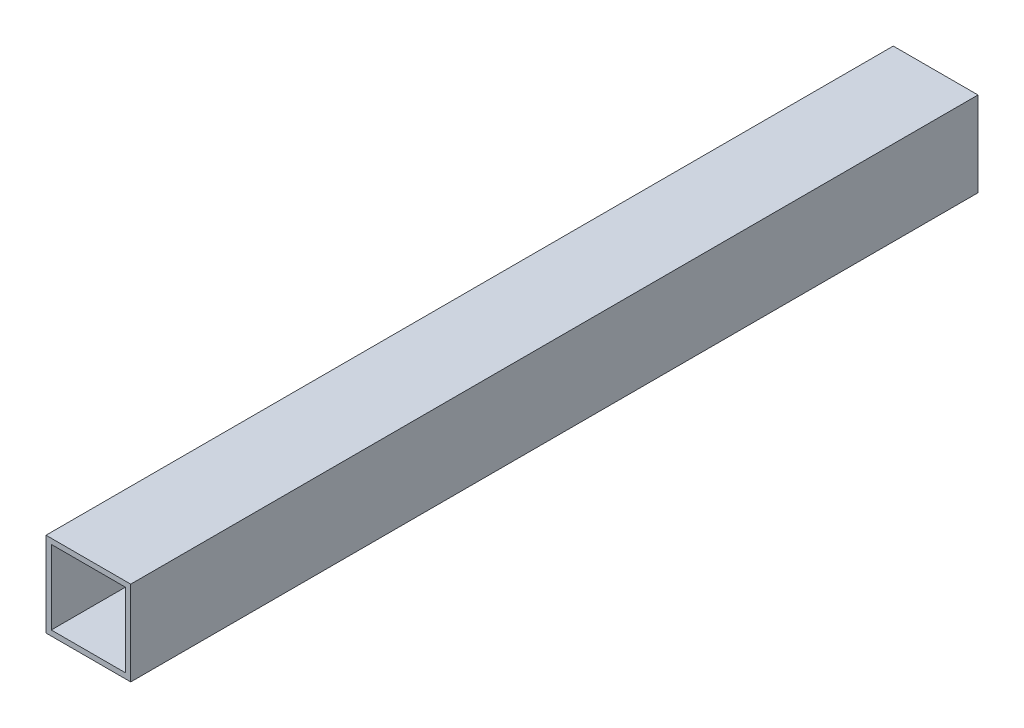
ISO-10303-21;
HEADER;
FILE_DESCRIPTION(('STEP AP214'),'2;1');
FILE_NAME('part.step','',(''),(''),'','','');
FILE_SCHEMA(('AUTOMOTIVE_DESIGN { 1 0 10303 214 1 1 1 1 }'));
ENDSEC;
DATA;
#1=APPLICATION_CONTEXT('core data for automotive mechanical design processes');
#2=APPLICATION_PROTOCOL_DEFINITION('international standard','automotive_design',2000,#1);
#3=PRODUCT_CONTEXT('',#1,'mechanical');
#4=PRODUCT('Part','Part','',(#3));
#5=PRODUCT_RELATED_PRODUCT_CATEGORY('part','',(#4));
#6=PRODUCT_DEFINITION_FORMATION('','',#4);
#7=PRODUCT_DEFINITION_CONTEXT('part definition',#1,'design');
#8=PRODUCT_DEFINITION('design','',#6,#7);
#9=PRODUCT_DEFINITION_SHAPE('','',#8);
#10=(LENGTH_UNIT() NAMED_UNIT(*) SI_UNIT(.MILLI.,.METRE.));
#11=(NAMED_UNIT(*) PLANE_ANGLE_UNIT() SI_UNIT($,.RADIAN.));
#12=(NAMED_UNIT(*) SI_UNIT($,.STERADIAN.) SOLID_ANGLE_UNIT());
#13=UNCERTAINTY_MEASURE_WITH_UNIT(LENGTH_MEASURE(1.E-05),#10,'distance_accuracy_value','');
#14=(GEOMETRIC_REPRESENTATION_CONTEXT(3) GLOBAL_UNCERTAINTY_ASSIGNED_CONTEXT((#13)) GLOBAL_UNIT_ASSIGNED_CONTEXT((#10,
#11,#12)) REPRESENTATION_CONTEXT('',''));
#15=CARTESIAN_POINT('',(0.,0.,0.));
#16=DIRECTION('',(0.,0.,1.));
#17=DIRECTION('',(1.,0.,0.));
#18=AXIS2_PLACEMENT_3D('',#15,#16,#17);
#19=CARTESIAN_POINT('',(0.,0.,508.));
#20=DIRECTION('',(0.,0.,-1.));
#21=DIRECTION('',(-1.,0.,0.));
#22=AXIS2_PLACEMENT_3D('',#19,#20,#21);
#23=PLANE('',#22);
#24=DIRECTION('',(0.,-1.,0.));
#25=VECTOR('',#24,1.);
#26=CARTESIAN_POINT('',(0.,0.,508.));
#27=LINE('',#26,#25);
#28=CARTESIAN_POINT('',(0.,50.8,508.));
#29=VERTEX_POINT('',#28);
#30=CARTESIAN_POINT('',(0.,0.,508.));
#31=VERTEX_POINT('',#30);
#32=EDGE_CURVE('E156',#29,#31,#27,.T.);
#33=ORIENTED_EDGE('',*,*,#32,.T.);
#34=DIRECTION('',(1.,0.,0.));
#35=VECTOR('',#34,1.);
#36=CARTESIAN_POINT('',(0.,0.,508.));
#37=LINE('',#36,#35);
#38=CARTESIAN_POINT('',(50.8,0.,508.));
#39=VERTEX_POINT('',#38);
#40=EDGE_CURVE('E160',#31,#39,#37,.T.);
#41=ORIENTED_EDGE('',*,*,#40,.T.);
#42=DIRECTION('',(0.,1.,0.));
#43=VECTOR('',#42,1.);
#44=CARTESIAN_POINT('',(50.8,0.,508.));
#45=LINE('',#44,#43);
#46=CARTESIAN_POINT('',(50.8,50.8,508.));
#47=VERTEX_POINT('',#46);
#48=EDGE_CURVE('E164',#39,#47,#45,.T.);
#49=ORIENTED_EDGE('',*,*,#48,.T.);
#50=DIRECTION('',(-1.,0.,0.));
#51=VECTOR('',#50,1.);
#52=CARTESIAN_POINT('',(0.,50.8,508.));
#53=LINE('',#52,#51);
#54=EDGE_CURVE('E167',#47,#29,#53,.T.);
#55=ORIENTED_EDGE('',*,*,#54,.T.);
#56=EDGE_LOOP('',(#33,#41,#49,#55));
#57=FACE_BOUND('',#56,.T.);
#58=DIRECTION('',(0.,-1.,0.));
#59=VECTOR('',#58,1.);
#60=CARTESIAN_POINT('',(3.175,3.175,508.));
#61=LINE('',#60,#59);
#62=CARTESIAN_POINT('',(3.175,47.625,508.));
#63=VERTEX_POINT('',#62);
#64=CARTESIAN_POINT('',(3.175,3.175,508.));
#65=VERTEX_POINT('',#64);
#66=EDGE_CURVE('E108',#63,#65,#61,.T.);
#67=ORIENTED_EDGE('',*,*,#66,.F.);
#68=DIRECTION('',(-1.,0.,0.));
#69=VECTOR('',#68,1.);
#70=CARTESIAN_POINT('',(3.175,47.625,508.));
#71=LINE('',#70,#69);
#72=CARTESIAN_POINT('',(47.625,47.625,508.));
#73=VERTEX_POINT('',#72);
#74=EDGE_CURVE('E134',#73,#63,#71,.T.);
#75=ORIENTED_EDGE('',*,*,#74,.F.);
#76=DIRECTION('',(0.,1.,0.));
#77=VECTOR('',#76,1.);
#78=CARTESIAN_POINT('',(47.625,3.175,508.));
#79=LINE('',#78,#77);
#80=CARTESIAN_POINT('',(47.625,3.175,508.));
#81=VERTEX_POINT('',#80);
#82=EDGE_CURVE('E130',#81,#73,#79,.T.);
#83=ORIENTED_EDGE('',*,*,#82,.F.);
#84=DIRECTION('',(1.,0.,0.));
#85=VECTOR('',#84,1.);
#86=CARTESIAN_POINT('',(3.175,3.175,508.));
#87=LINE('',#86,#85);
#88=EDGE_CURVE('E117',#65,#81,#87,.T.);
#89=ORIENTED_EDGE('',*,*,#88,.F.);
#90=EDGE_LOOP('',(#67,#75,#83,#89));
#91=FACE_BOUND('',#90,.T.);
#92=ADVANCED_FACE('F42',(#57,#91),#23,.F.);
#93=CARTESIAN_POINT('',(0.,0.,0.));
#94=DIRECTION('',(0.,0.,-1.));
#95=DIRECTION('',(-1.,0.,0.));
#96=AXIS2_PLACEMENT_3D('',#93,#94,#95);
#97=PLANE('',#96);
#98=DIRECTION('',(0.,-1.,0.));
#99=VECTOR('',#98,1.);
#100=CARTESIAN_POINT('',(0.,0.,0.));
#101=LINE('',#100,#99);
#102=CARTESIAN_POINT('',(0.,50.8,0.));
#103=VERTEX_POINT('',#102);
#104=CARTESIAN_POINT('',(0.,0.,0.));
#105=VERTEX_POINT('',#104);
#106=EDGE_CURVE('E126',#103,#105,#101,.T.);
#107=ORIENTED_EDGE('',*,*,#106,.F.);
#108=DIRECTION('',(-1.,0.,0.));
#109=VECTOR('',#108,1.);
#110=CARTESIAN_POINT('',(0.,50.8,0.));
#111=LINE('',#110,#109);
#112=CARTESIAN_POINT('',(50.8,50.8,0.));
#113=VERTEX_POINT('',#112);
#114=EDGE_CURVE('E161',#113,#103,#111,.T.);
#115=ORIENTED_EDGE('',*,*,#114,.F.);
#116=DIRECTION('',(0.,1.,0.));
#117=VECTOR('',#116,1.);
#118=CARTESIAN_POINT('',(50.8,0.,0.));
#119=LINE('',#118,#117);
#120=CARTESIAN_POINT('',(50.8,0.,0.));
#121=VERTEX_POINT('',#120);
#122=EDGE_CURVE('E177',#121,#113,#119,.T.);
#123=ORIENTED_EDGE('',*,*,#122,.F.);
#124=DIRECTION('',(1.,0.,0.));
#125=VECTOR('',#124,1.);
#126=CARTESIAN_POINT('',(0.,0.,0.));
#127=LINE('',#126,#125);
#128=EDGE_CURVE('E174',#105,#121,#127,.T.);
#129=ORIENTED_EDGE('',*,*,#128,.F.);
#130=EDGE_LOOP('',(#107,#115,#123,#129));
#131=FACE_BOUND('',#130,.T.);
#132=DIRECTION('',(-1.,0.,0.));
#133=VECTOR('',#132,1.);
#134=CARTESIAN_POINT('',(3.175,47.625,0.));
#135=LINE('',#134,#133);
#136=CARTESIAN_POINT('',(47.625,47.625,0.));
#137=VERTEX_POINT('',#136);
#138=CARTESIAN_POINT('',(3.175,47.625,0.));
#139=VERTEX_POINT('',#138);
#140=EDGE_CURVE('E118',#137,#139,#135,.T.);
#141=ORIENTED_EDGE('',*,*,#140,.T.);
#142=DIRECTION('',(0.,-1.,0.));
#143=VECTOR('',#142,1.);
#144=CARTESIAN_POINT('',(3.175,3.175,0.));
#145=LINE('',#144,#143);
#146=CARTESIAN_POINT('',(3.175,3.175,0.));
#147=VERTEX_POINT('',#146);
#148=EDGE_CURVE('E66',#139,#147,#145,.T.);
#149=ORIENTED_EDGE('',*,*,#148,.T.);
#150=DIRECTION('',(1.,0.,0.));
#151=VECTOR('',#150,1.);
#152=CARTESIAN_POINT('',(3.175,3.175,0.));
#153=LINE('',#152,#151);
#154=CARTESIAN_POINT('',(47.625,3.175,0.));
#155=VERTEX_POINT('',#154);
#156=EDGE_CURVE('E124',#147,#155,#153,.T.);
#157=ORIENTED_EDGE('',*,*,#156,.T.);
#158=DIRECTION('',(0.,1.,0.));
#159=VECTOR('',#158,1.);
#160=CARTESIAN_POINT('',(47.625,3.175,0.));
#161=LINE('',#160,#159);
#162=EDGE_CURVE('E143',#155,#137,#161,.T.);
#163=ORIENTED_EDGE('',*,*,#162,.T.);
#164=EDGE_LOOP('',(#141,#149,#157,#163));
#165=FACE_BOUND('',#164,.T.);
#166=ADVANCED_FACE('F200',(#131,#165),#97,.T.);
#167=CARTESIAN_POINT('',(0.,0.,508.));
#168=DIRECTION('',(1.,0.,0.));
#169=DIRECTION('',(0.,0.,-1.));
#170=AXIS2_PLACEMENT_3D('',#167,#168,#169);
#171=PLANE('',#170);
#172=ORIENTED_EDGE('',*,*,#106,.T.);
#173=DIRECTION('',(0.,0.,-1.));
#174=VECTOR('',#173,1.);
#175=CARTESIAN_POINT('',(0.,0.,508.));
#176=LINE('',#175,#174);
#177=EDGE_CURVE('E11',#31,#105,#176,.T.);
#178=ORIENTED_EDGE('',*,*,#177,.F.);
#179=ORIENTED_EDGE('',*,*,#32,.F.);
#180=DIRECTION('',(0.,0.,-1.));
#181=VECTOR('',#180,1.);
#182=CARTESIAN_POINT('',(0.,50.8,508.));
#183=LINE('',#182,#181);
#184=EDGE_CURVE('E170',#29,#103,#183,.T.);
#185=ORIENTED_EDGE('',*,*,#184,.T.);
#186=EDGE_LOOP('',(#172,#178,#179,#185));
#187=FACE_BOUND('',#186,.T.);
#188=ADVANCED_FACE('F44',(#187),#171,.F.);
#189=CARTESIAN_POINT('',(0.,0.,508.));
#190=DIRECTION('',(0.,1.,0.));
#191=DIRECTION('',(0.,0.,1.));
#192=AXIS2_PLACEMENT_3D('',#189,#190,#191);
#193=PLANE('',#192);
#194=ORIENTED_EDGE('',*,*,#128,.T.);
#195=DIRECTION('',(0.,0.,-1.));
#196=VECTOR('',#195,1.);
#197=CARTESIAN_POINT('',(50.8,0.,508.));
#198=LINE('',#197,#196);
#199=EDGE_CURVE('E51',#39,#121,#198,.T.);
#200=ORIENTED_EDGE('',*,*,#199,.F.);
#201=ORIENTED_EDGE('',*,*,#40,.F.);
#202=ORIENTED_EDGE('',*,*,#177,.T.);
#203=EDGE_LOOP('',(#194,#200,#201,#202));
#204=FACE_BOUND('',#203,.T.);
#205=ADVANCED_FACE('F210',(#204),#193,.F.);
#206=CARTESIAN_POINT('',(50.8,0.,508.));
#207=DIRECTION('',(-1.,0.,0.));
#208=DIRECTION('',(0.,0.,1.));
#209=AXIS2_PLACEMENT_3D('',#206,#207,#208);
#210=PLANE('',#209);
#211=ORIENTED_EDGE('',*,*,#122,.T.);
#212=DIRECTION('',(0.,0.,-1.));
#213=VECTOR('',#212,1.);
#214=CARTESIAN_POINT('',(50.8,50.8,508.));
#215=LINE('',#214,#213);
#216=EDGE_CURVE('E185',#47,#113,#215,.T.);
#217=ORIENTED_EDGE('',*,*,#216,.F.);
#218=ORIENTED_EDGE('',*,*,#48,.F.);
#219=ORIENTED_EDGE('',*,*,#199,.T.);
#220=EDGE_LOOP('',(#211,#217,#218,#219));
#221=FACE_BOUND('',#220,.T.);
#222=ADVANCED_FACE('F194',(#221),#210,.F.);
#223=CARTESIAN_POINT('',(0.,50.8,508.));
#224=DIRECTION('',(0.,-1.,0.));
#225=DIRECTION('',(0.,0.,-1.));
#226=AXIS2_PLACEMENT_3D('',#223,#224,#225);
#227=PLANE('',#226);
#228=ORIENTED_EDGE('',*,*,#114,.T.);
#229=ORIENTED_EDGE('',*,*,#184,.F.);
#230=ORIENTED_EDGE('',*,*,#54,.F.);
#231=ORIENTED_EDGE('',*,*,#216,.T.);
#232=EDGE_LOOP('',(#228,#229,#230,#231));
#233=FACE_BOUND('',#232,.T.);
#234=ADVANCED_FACE('F204',(#233),#227,.F.);
#235=CARTESIAN_POINT('',(3.175,3.175,508.));
#236=DIRECTION('',(1.,0.,0.));
#237=DIRECTION('',(0.,0.,-1.));
#238=AXIS2_PLACEMENT_3D('',#235,#236,#237);
#239=PLANE('',#238);
#240=ORIENTED_EDGE('',*,*,#148,.F.);
#241=DIRECTION('',(0.,0.,-1.));
#242=VECTOR('',#241,1.);
#243=CARTESIAN_POINT('',(3.175,47.625,508.));
#244=LINE('',#243,#242);
#245=EDGE_CURVE('E112',#63,#139,#244,.T.);
#246=ORIENTED_EDGE('',*,*,#245,.F.);
#247=ORIENTED_EDGE('',*,*,#66,.T.);
#248=DIRECTION('',(0.,0.,-1.));
#249=VECTOR('',#248,1.);
#250=CARTESIAN_POINT('',(3.175,3.175,508.));
#251=LINE('',#250,#249);
#252=EDGE_CURVE('E111',#65,#147,#251,.T.);
#253=ORIENTED_EDGE('',*,*,#252,.T.);
#254=EDGE_LOOP('',(#240,#246,#247,#253));
#255=FACE_BOUND('',#254,.T.);
#256=ADVANCED_FACE('F110',(#255),#239,.T.);
#257=CARTESIAN_POINT('',(3.175,3.175,508.));
#258=DIRECTION('',(0.,1.,0.));
#259=DIRECTION('',(0.,0.,1.));
#260=AXIS2_PLACEMENT_3D('',#257,#258,#259);
#261=PLANE('',#260);
#262=ORIENTED_EDGE('',*,*,#156,.F.);
#263=ORIENTED_EDGE('',*,*,#252,.F.);
#264=ORIENTED_EDGE('',*,*,#88,.T.);
#265=DIRECTION('',(0.,0.,-1.));
#266=VECTOR('',#265,1.);
#267=CARTESIAN_POINT('',(47.625,3.175,508.));
#268=LINE('',#267,#266);
#269=EDGE_CURVE('E127',#81,#155,#268,.T.);
#270=ORIENTED_EDGE('',*,*,#269,.T.);
#271=EDGE_LOOP('',(#262,#263,#264,#270));
#272=FACE_BOUND('',#271,.T.);
#273=ADVANCED_FACE('F121',(#272),#261,.T.);
#274=CARTESIAN_POINT('',(47.625,3.175,508.));
#275=DIRECTION('',(-1.,0.,0.));
#276=DIRECTION('',(0.,0.,1.));
#277=AXIS2_PLACEMENT_3D('',#274,#275,#276);
#278=PLANE('',#277);
#279=ORIENTED_EDGE('',*,*,#162,.F.);
#280=ORIENTED_EDGE('',*,*,#269,.F.);
#281=ORIENTED_EDGE('',*,*,#82,.T.);
#282=DIRECTION('',(0.,0.,-1.));
#283=VECTOR('',#282,1.);
#284=CARTESIAN_POINT('',(47.625,47.625,508.));
#285=LINE('',#284,#283);
#286=EDGE_CURVE('E58',#73,#137,#285,.T.);
#287=ORIENTED_EDGE('',*,*,#286,.T.);
#288=EDGE_LOOP('',(#279,#280,#281,#287));
#289=FACE_BOUND('',#288,.T.);
#290=ADVANCED_FACE('F233',(#289),#278,.T.);
#291=CARTESIAN_POINT('',(3.175,47.625,508.));
#292=DIRECTION('',(0.,-1.,0.));
#293=DIRECTION('',(0.,0.,-1.));
#294=AXIS2_PLACEMENT_3D('',#291,#292,#293);
#295=PLANE('',#294);
#296=ORIENTED_EDGE('',*,*,#140,.F.);
#297=ORIENTED_EDGE('',*,*,#286,.F.);
#298=ORIENTED_EDGE('',*,*,#74,.T.);
#299=ORIENTED_EDGE('',*,*,#245,.T.);
#300=EDGE_LOOP('',(#296,#297,#298,#299));
#301=FACE_BOUND('',#300,.T.);
#302=ADVANCED_FACE('F237',(#301),#295,.T.);
#303=CLOSED_SHELL('',(#92,#166,#188,#205,#222,#234,#256,#273,#290,#302));
#304=MANIFOLD_SOLID_BREP('B2',#303);
#305=ADVANCED_BREP_SHAPE_REPRESENTATION('',(#18,#304),#14);
#306=SHAPE_DEFINITION_REPRESENTATION(#9,#305);
ENDSEC;
END-ISO-10303-21;
